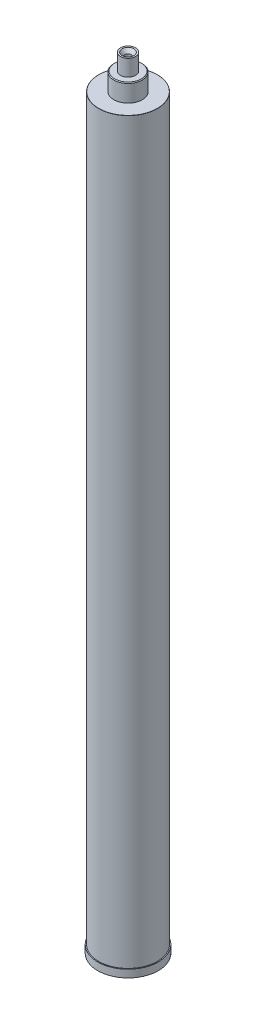
ISO-10303-21;
HEADER;
FILE_DESCRIPTION(('STEP AP214'),'2;1');
FILE_NAME('part.step','',(''),(''),'','','');
FILE_SCHEMA(('AUTOMOTIVE_DESIGN { 1 0 10303 214 1 1 1 1 }'));
ENDSEC;
DATA;
#1=APPLICATION_CONTEXT('core data for automotive mechanical design processes');
#2=APPLICATION_PROTOCOL_DEFINITION('international standard','automotive_design',2000,#1);
#3=PRODUCT_CONTEXT('',#1,'mechanical');
#4=PRODUCT('Part','Part','',(#3));
#5=PRODUCT_RELATED_PRODUCT_CATEGORY('part','',(#4));
#6=PRODUCT_DEFINITION_FORMATION('','',#4);
#7=PRODUCT_DEFINITION_CONTEXT('part definition',#1,'design');
#8=PRODUCT_DEFINITION('design','',#6,#7);
#9=PRODUCT_DEFINITION_SHAPE('','',#8);
#10=(LENGTH_UNIT() NAMED_UNIT(*) SI_UNIT(.MILLI.,.METRE.));
#11=(NAMED_UNIT(*) PLANE_ANGLE_UNIT() SI_UNIT($,.RADIAN.));
#12=(NAMED_UNIT(*) SI_UNIT($,.STERADIAN.) SOLID_ANGLE_UNIT());
#13=UNCERTAINTY_MEASURE_WITH_UNIT(LENGTH_MEASURE(1.E-05),#10,'distance_accuracy_value','');
#14=(GEOMETRIC_REPRESENTATION_CONTEXT(3) GLOBAL_UNCERTAINTY_ASSIGNED_CONTEXT((#13)) GLOBAL_UNIT_ASSIGNED_CONTEXT((#10,
#11,#12)) REPRESENTATION_CONTEXT('',''));
#15=CARTESIAN_POINT('',(0.,0.,0.));
#16=DIRECTION('',(0.,0.,1.));
#17=DIRECTION('',(1.,0.,0.));
#18=AXIS2_PLACEMENT_3D('',#15,#16,#17);
#19=CARTESIAN_POINT('',(0.,1238.504,0.));
#20=DIRECTION('',(0.,-1.,0.));
#21=DIRECTION('',(0.,0.,-1.));
#22=AXIS2_PLACEMENT_3D('',#19,#20,#21);
#23=CYLINDRICAL_SURFACE('',#22,49.2125);
#24=CARTESIAN_POINT('',(0.,1238.25,0.));
#25=DIRECTION('',(0.,1.,0.));
#26=DIRECTION('',(0.,0.,1.));
#27=AXIS2_PLACEMENT_3D('',#24,#25,#26);
#28=CIRCLE('',#27,49.2125);
#29=CARTESIAN_POINT('',(0.,1238.25,49.2125));
#30=VERTEX_POINT('',#29);
#31=EDGE_CURVE('E11',#30,#30,#28,.F.);
#32=ORIENTED_EDGE('',*,*,#31,.T.);
#33=EDGE_LOOP('',(#32));
#34=FACE_BOUND('',#33,.T.);
#35=CARTESIAN_POINT('',(0.,0.,0.));
#36=DIRECTION('',(0.,1.,0.));
#37=DIRECTION('',(0.,0.,1.));
#38=AXIS2_PLACEMENT_3D('',#35,#36,#37);
#39=CIRCLE('',#38,49.2125);
#40=CARTESIAN_POINT('',(0.,0.,49.2125));
#41=VERTEX_POINT('',#40);
#42=EDGE_CURVE('E70',#41,#41,#39,.T.);
#43=ORIENTED_EDGE('',*,*,#42,.T.);
#44=EDGE_LOOP('',(#43));
#45=FACE_BOUND('',#44,.T.);
#46=ADVANCED_FACE('F39',(#34,#45),#23,.T.);
#47=CARTESIAN_POINT('',(0.,1238.504,0.));
#48=DIRECTION('',(0.,1.,0.));
#49=DIRECTION('',(0.,0.,1.));
#50=AXIS2_PLACEMENT_3D('',#47,#48,#49);
#51=PLANE('',#50);
#52=CARTESIAN_POINT('',(0.,1238.504,0.));
#53=DIRECTION('',(0.,1.,0.));
#54=DIRECTION('',(0.,0.,1.));
#55=AXIS2_PLACEMENT_3D('',#52,#53,#54);
#56=CIRCLE('',#55,48.9585);
#57=CARTESIAN_POINT('',(0.,1238.504,48.9585));
#58=VERTEX_POINT('',#57);
#59=EDGE_CURVE('E46',#58,#58,#56,.T.);
#60=ORIENTED_EDGE('',*,*,#59,.T.);
#61=EDGE_LOOP('',(#60));
#62=FACE_BOUND('',#61,.T.);
#63=CARTESIAN_POINT('',(0.,1238.504,0.));
#64=DIRECTION('',(0.,-1.,0.));
#65=DIRECTION('',(0.,0.,-1.));
#66=AXIS2_PLACEMENT_3D('',#63,#64,#65);
#67=CIRCLE('',#66,23.876);
#68=CARTESIAN_POINT('',(0.,1238.504,-23.876));
#69=VERTEX_POINT('',#68);
#70=EDGE_CURVE('E72',#69,#69,#67,.T.);
#71=ORIENTED_EDGE('',*,*,#70,.T.);
#72=EDGE_LOOP('',(#71));
#73=FACE_BOUND('',#72,.T.);
#74=ADVANCED_FACE('F91',(#62,#73),#51,.T.);
#75=CARTESIAN_POINT('',(0.,1295.654,0.));
#76=DIRECTION('',(0.,1.,0.));
#77=DIRECTION('',(0.,0.,1.));
#78=AXIS2_PLACEMENT_3D('',#75,#76,#77);
#79=PLANE('',#78);
#80=CARTESIAN_POINT('',(0.,1295.654,0.));
#81=DIRECTION('',(0.,1.,0.));
#82=DIRECTION('',(0.,0.,1.));
#83=AXIS2_PLACEMENT_3D('',#80,#81,#82);
#84=CIRCLE('',#83,9.9187);
#85=CARTESIAN_POINT('',(0.,1295.654,9.9187));
#86=VERTEX_POINT('',#85);
#87=EDGE_CURVE('E65',#86,#86,#84,.T.);
#88=ORIENTED_EDGE('',*,*,#87,.F.);
#89=EDGE_LOOP('',(#88));
#90=FACE_BOUND('',#89,.T.);
#91=CARTESIAN_POINT('',(0.,1295.654,0.));
#92=DIRECTION('',(0.,-1.,0.));
#93=DIRECTION('',(0.,0.,-1.));
#94=AXIS2_PLACEMENT_3D('',#91,#92,#93);
#95=CIRCLE('',#94,12.7);
#96=CARTESIAN_POINT('',(0.,1295.654,-12.7));
#97=VERTEX_POINT('',#96);
#98=EDGE_CURVE('E78',#97,#97,#95,.T.);
#99=ORIENTED_EDGE('',*,*,#98,.F.);
#100=EDGE_LOOP('',(#99));
#101=FACE_BOUND('',#100,.T.);
#102=ADVANCED_FACE('F109',(#90,#101),#79,.T.);
#103=CARTESIAN_POINT('',(0.,1238.504,0.));
#104=DIRECTION('',(0.,-1.,0.));
#105=DIRECTION('',(0.,0.,-1.));
#106=AXIS2_PLACEMENT_3D('',#103,#104,#105);
#107=CYLINDRICAL_SURFACE('',#106,12.7);
#108=ORIENTED_EDGE('',*,*,#98,.T.);
#109=EDGE_LOOP('',(#108));
#110=FACE_BOUND('',#109,.T.);
#111=CARTESIAN_POINT('',(0.,1268.349,0.));
#112=DIRECTION('',(0.,-1.,0.));
#113=DIRECTION('',(0.,0.,-1.));
#114=AXIS2_PLACEMENT_3D('',#111,#112,#113);
#115=CIRCLE('',#114,12.7);
#116=CARTESIAN_POINT('',(0.,1268.349,-12.7));
#117=VERTEX_POINT('',#116);
#118=EDGE_CURVE('E75',#117,#117,#115,.T.);
#119=ORIENTED_EDGE('',*,*,#118,.F.);
#120=EDGE_LOOP('',(#119));
#121=FACE_BOUND('',#120,.T.);
#122=ADVANCED_FACE('F115',(#110,#121),#107,.T.);
#123=CARTESIAN_POINT('',(12.7,1268.349,0.));
#124=DIRECTION('',(0.,1.,0.));
#125=DIRECTION('',(0.,0.,1.));
#126=AXIS2_PLACEMENT_3D('',#123,#124,#125);
#127=PLANE('',#126);
#128=CARTESIAN_POINT('',(0.,1268.349,0.));
#129=DIRECTION('',(0.,1.,0.));
#130=DIRECTION('',(0.,0.,1.));
#131=AXIS2_PLACEMENT_3D('',#128,#129,#130);
#132=CIRCLE('',#131,22.6059999999998);
#133=CARTESIAN_POINT('',(0.,1268.349,22.6059999999998));
#134=VERTEX_POINT('',#133);
#135=EDGE_CURVE('E86',#134,#134,#132,.T.);
#136=ORIENTED_EDGE('',*,*,#135,.T.);
#137=EDGE_LOOP('',(#136));
#138=FACE_BOUND('',#137,.T.);
#139=ORIENTED_EDGE('',*,*,#118,.T.);
#140=EDGE_LOOP('',(#139));
#141=FACE_BOUND('',#140,.T.);
#142=ADVANCED_FACE('F119',(#138,#141),#127,.T.);
#143=CARTESIAN_POINT('',(0.,1238.504,0.));
#144=DIRECTION('',(0.,-1.,0.));
#145=DIRECTION('',(0.,0.,-1.));
#146=AXIS2_PLACEMENT_3D('',#143,#144,#145);
#147=CYLINDRICAL_SURFACE('',#146,23.876);
#148=CARTESIAN_POINT('',(0.,1267.079,0.));
#149=DIRECTION('',(0.,1.,0.));
#150=DIRECTION('',(0.,0.,1.));
#151=AXIS2_PLACEMENT_3D('',#148,#149,#150);
#152=CIRCLE('',#151,23.876);
#153=CARTESIAN_POINT('',(0.,1267.079,23.876));
#154=VERTEX_POINT('',#153);
#155=EDGE_CURVE('E81',#154,#154,#152,.F.);
#156=ORIENTED_EDGE('',*,*,#155,.T.);
#157=EDGE_LOOP('',(#156));
#158=FACE_BOUND('',#157,.T.);
#159=ORIENTED_EDGE('',*,*,#70,.F.);
#160=EDGE_LOOP('',(#159));
#161=FACE_BOUND('',#160,.T.);
#162=ADVANCED_FACE('F123',(#158,#161),#147,.T.);
#163=CARTESIAN_POINT('',(0.,-12.7,0.));
#164=DIRECTION('',(0.,1.,0.));
#165=DIRECTION('',(0.,0.,1.));
#166=AXIS2_PLACEMENT_3D('',#163,#164,#165);
#167=CYLINDRICAL_SURFACE('',#166,50.8);
#168=CARTESIAN_POINT('',(0.,-12.7,0.));
#169=DIRECTION('',(0.,-1.,0.));
#170=DIRECTION('',(0.,0.,-1.));
#171=AXIS2_PLACEMENT_3D('',#168,#169,#170);
#172=CIRCLE('',#171,50.8);
#173=CARTESIAN_POINT('',(0.,-12.7,-50.8));
#174=VERTEX_POINT('',#173);
#175=EDGE_CURVE('E62',#174,#174,#172,.T.);
#176=ORIENTED_EDGE('',*,*,#175,.F.);
#177=EDGE_LOOP('',(#176));
#178=FACE_BOUND('',#177,.T.);
#179=CARTESIAN_POINT('',(0.,0.,0.));
#180=DIRECTION('',(0.,-1.,0.));
#181=DIRECTION('',(0.,0.,-1.));
#182=AXIS2_PLACEMENT_3D('',#179,#180,#181);
#183=CIRCLE('',#182,50.8);
#184=CARTESIAN_POINT('',(0.,0.,-50.8));
#185=VERTEX_POINT('',#184);
#186=EDGE_CURVE('E58',#185,#185,#183,.T.);
#187=ORIENTED_EDGE('',*,*,#186,.T.);
#188=EDGE_LOOP('',(#187));
#189=FACE_BOUND('',#188,.T.);
#190=ADVANCED_FACE('F127',(#178,#189),#167,.T.);
#191=CARTESIAN_POINT('',(0.,-12.7,0.));
#192=DIRECTION('',(0.,-1.,0.));
#193=DIRECTION('',(0.,0.,-1.));
#194=AXIS2_PLACEMENT_3D('',#191,#192,#193);
#195=PLANE('',#194);
#196=ORIENTED_EDGE('',*,*,#175,.T.);
#197=EDGE_LOOP('',(#196));
#198=FACE_BOUND('',#197,.T.);
#199=ADVANCED_FACE('F131',(#198),#195,.T.);
#200=CARTESIAN_POINT('',(0.,0.,0.));
#201=DIRECTION('',(0.,-1.,0.));
#202=DIRECTION('',(0.,0.,-1.));
#203=AXIS2_PLACEMENT_3D('',#200,#201,#202);
#204=PLANE('',#203);
#205=ORIENTED_EDGE('',*,*,#42,.F.);
#206=EDGE_LOOP('',(#205));
#207=FACE_BOUND('',#206,.T.);
#208=ORIENTED_EDGE('',*,*,#186,.F.);
#209=EDGE_LOOP('',(#208));
#210=FACE_BOUND('',#209,.T.);
#211=ADVANCED_FACE('F100',(#207,#210),#204,.F.);
#212=CARTESIAN_POINT('',(0.,1267.079,0.));
#213=DIRECTION('',(0.,-1.,0.));
#214=DIRECTION('',(0.,0.,-1.));
#215=AXIS2_PLACEMENT_3D('',#212,#213,#214);
#216=CONICAL_SURFACE('',#215,23.876,0.785398163397401);
#217=ORIENTED_EDGE('',*,*,#135,.F.);
#218=EDGE_LOOP('',(#217));
#219=FACE_BOUND('',#218,.T.);
#220=ORIENTED_EDGE('',*,*,#155,.F.);
#221=EDGE_LOOP('',(#220));
#222=FACE_BOUND('',#221,.T.);
#223=ADVANCED_FACE('F95',(#219,#222),#216,.T.);
#224=CARTESIAN_POINT('',(0.,1238.25,0.));
#225=DIRECTION('',(0.,1.,0.));
#226=DIRECTION('',(0.,0.,1.));
#227=AXIS2_PLACEMENT_3D('',#224,#225,#226);
#228=TOROIDAL_SURFACE('',#227,48.9585,0.254);
#229=ORIENTED_EDGE('',*,*,#31,.F.);
#230=EDGE_LOOP('',(#229));
#231=FACE_BOUND('',#230,.T.);
#232=ORIENTED_EDGE('',*,*,#59,.F.);
#233=EDGE_LOOP('',(#232));
#234=FACE_BOUND('',#233,.T.);
#235=ADVANCED_FACE('F41',(#231,#234),#228,.T.);
#236=CARTESIAN_POINT('',(0.,1270.254,0.));
#237=DIRECTION('',(0.,1.,0.));
#238=DIRECTION('',(0.,0.,1.));
#239=AXIS2_PLACEMENT_3D('',#236,#237,#238);
#240=CONICAL_SURFACE('',#239,4.90219999999999,1.02974425867666);
#241=CARTESIAN_POINT('',(0.,1267.3084610734,0.));
#242=VERTEX_POINT('',#241);
#243=VERTEX_LOOP('',#242);
#244=FACE_BOUND('',#243,.T.);
#245=CARTESIAN_POINT('',(0.,1270.254,0.));
#246=DIRECTION('',(0.,1.,0.));
#247=DIRECTION('',(0.,0.,1.));
#248=AXIS2_PLACEMENT_3D('',#245,#246,#247);
#249=CIRCLE('',#248,4.90219999999999);
#250=CARTESIAN_POINT('',(0.,1270.254,4.90219999999999));
#251=VERTEX_POINT('',#250);
#252=EDGE_CURVE('E56',#251,#251,#249,.T.);
#253=ORIENTED_EDGE('',*,*,#252,.T.);
#254=EDGE_LOOP('',(#253));
#255=FACE_BOUND('',#254,.T.);
#256=ADVANCED_FACE('F49',(#244,#255),#240,.F.);
#257=CARTESIAN_POINT('',(0.,1295.654,0.));
#258=DIRECTION('',(0.,1.,0.));
#259=DIRECTION('',(0.,0.,1.));
#260=AXIS2_PLACEMENT_3D('',#257,#258,#259);
#261=CYLINDRICAL_SURFACE('',#260,4.9022);
#262=ORIENTED_EDGE('',*,*,#252,.F.);
#263=EDGE_LOOP('',(#262));
#264=FACE_BOUND('',#263,.T.);
#265=CARTESIAN_POINT('',(0.,1289.88317688518,0.));
#266=DIRECTION('',(0.,1.,0.));
#267=DIRECTION('',(0.,0.,1.));
#268=AXIS2_PLACEMENT_3D('',#265,#266,#267);
#269=CIRCLE('',#268,4.9022);
#270=CARTESIAN_POINT('',(0.,1289.88317688518,4.9022));
#271=VERTEX_POINT('',#270);
#272=EDGE_CURVE('E59',#271,#271,#269,.T.);
#273=ORIENTED_EDGE('',*,*,#272,.T.);
#274=EDGE_LOOP('',(#273));
#275=FACE_BOUND('',#274,.T.);
#276=ADVANCED_FACE('F52',(#264,#275),#261,.F.);
#277=CARTESIAN_POINT('',(0.,1295.654,0.));
#278=DIRECTION('',(0.,1.,0.));
#279=DIRECTION('',(0.,0.,1.));
#280=AXIS2_PLACEMENT_3D('',#277,#278,#279);
#281=CONICAL_SURFACE('',#280,9.9187,0.715584993317681);
#282=ORIENTED_EDGE('',*,*,#272,.F.);
#283=EDGE_LOOP('',(#282));
#284=FACE_BOUND('',#283,.T.);
#285=ORIENTED_EDGE('',*,*,#87,.T.);
#286=EDGE_LOOP('',(#285));
#287=FACE_BOUND('',#286,.T.);
#288=ADVANCED_FACE('F141',(#284,#287),#281,.F.);
#289=CLOSED_SHELL('',(#46,#74,#102,#122,#142,#162,#190,#199,#211,#223,#235,#256,#276,#288));
#290=MANIFOLD_SOLID_BREP('B2',#289);
#291=ADVANCED_BREP_SHAPE_REPRESENTATION('',(#18,#290),#14);
#292=SHAPE_DEFINITION_REPRESENTATION(#9,#291);
ENDSEC;
END-ISO-10303-21;
